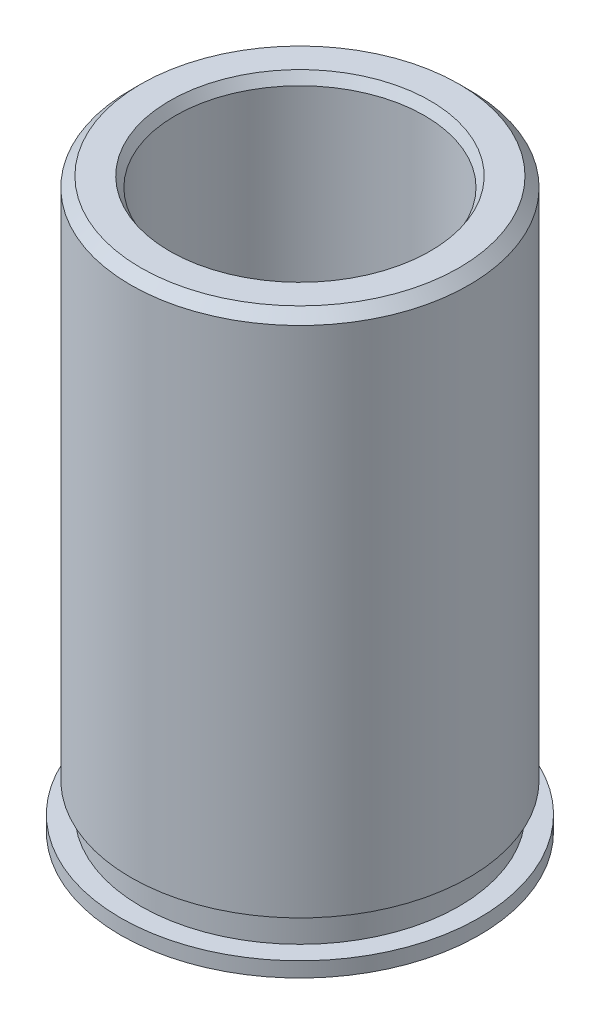
ISO-10303-21;
HEADER;
FILE_DESCRIPTION(('STEP AP214'),'2;1');
FILE_NAME('part.step','',(''),(''),'','','');
FILE_SCHEMA(('AUTOMOTIVE_DESIGN { 1 0 10303 214 1 1 1 1 }'));
ENDSEC;
DATA;
#1=APPLICATION_CONTEXT('core data for automotive mechanical design processes');
#2=APPLICATION_PROTOCOL_DEFINITION('international standard','automotive_design',2000,#1);
#3=PRODUCT_CONTEXT('',#1,'mechanical');
#4=PRODUCT('Part','Part','',(#3));
#5=PRODUCT_RELATED_PRODUCT_CATEGORY('part','',(#4));
#6=PRODUCT_DEFINITION_FORMATION('','',#4);
#7=PRODUCT_DEFINITION_CONTEXT('part definition',#1,'design');
#8=PRODUCT_DEFINITION('design','',#6,#7);
#9=PRODUCT_DEFINITION_SHAPE('','',#8);
#10=(LENGTH_UNIT() NAMED_UNIT(*) SI_UNIT(.MILLI.,.METRE.));
#11=(NAMED_UNIT(*) PLANE_ANGLE_UNIT() SI_UNIT($,.RADIAN.));
#12=(NAMED_UNIT(*) SI_UNIT($,.STERADIAN.) SOLID_ANGLE_UNIT());
#13=UNCERTAINTY_MEASURE_WITH_UNIT(LENGTH_MEASURE(1.E-05),#10,'distance_accuracy_value','');
#14=(GEOMETRIC_REPRESENTATION_CONTEXT(3) GLOBAL_UNCERTAINTY_ASSIGNED_CONTEXT((#13)) GLOBAL_UNIT_ASSIGNED_CONTEXT((#10,
#11,#12)) REPRESENTATION_CONTEXT('',''));
#15=CARTESIAN_POINT('',(0.,0.,0.));
#16=DIRECTION('',(0.,0.,1.));
#17=DIRECTION('',(1.,0.,0.));
#18=AXIS2_PLACEMENT_3D('',#15,#16,#17);
#19=CARTESIAN_POINT('',(0.,7.239,0.));
#20=DIRECTION('',(0.,1.,0.));
#21=DIRECTION('',(0.,0.,1.));
#22=AXIS2_PLACEMENT_3D('',#19,#20,#21);
#23=CYLINDRICAL_SURFACE('',#22,4.572);
#24=CARTESIAN_POINT('',(0.,-7.239,0.));
#25=DIRECTION('',(0.,1.,0.));
#26=DIRECTION('',(0.,0.,1.));
#27=AXIS2_PLACEMENT_3D('',#24,#25,#26);
#28=CIRCLE('',#27,4.572);
#29=CARTESIAN_POINT('',(0.,-7.239,4.572));
#30=VERTEX_POINT('',#29);
#31=EDGE_CURVE('E51',#30,#30,#28,.T.);
#32=ORIENTED_EDGE('',*,*,#31,.T.);
#33=EDGE_LOOP('',(#32));
#34=FACE_BOUND('',#33,.T.);
#35=CARTESIAN_POINT('',(0.,-6.858,0.));
#36=DIRECTION('',(0.,1.,0.));
#37=DIRECTION('',(0.,0.,1.));
#38=AXIS2_PLACEMENT_3D('',#35,#36,#37);
#39=CIRCLE('',#38,4.572);
#40=CARTESIAN_POINT('',(0.,-6.858,4.572));
#41=VERTEX_POINT('',#40);
#42=EDGE_CURVE('E9',#41,#41,#39,.T.);
#43=ORIENTED_EDGE('',*,*,#42,.F.);
#44=EDGE_LOOP('',(#43));
#45=FACE_BOUND('',#44,.T.);
#46=ADVANCED_FACE('F14',(#34,#45),#23,.T.);
#47=CARTESIAN_POINT('',(2.286,-6.858,0.));
#48=DIRECTION('',(0.,1.,0.));
#49=DIRECTION('',(0.,0.,1.));
#50=AXIS2_PLACEMENT_3D('',#47,#48,#49);
#51=PLANE('',#50);
#52=ORIENTED_EDGE('',*,*,#42,.T.);
#53=EDGE_LOOP('',(#52));
#54=FACE_BOUND('',#53,.T.);
#55=CARTESIAN_POINT('',(0.,-6.858,0.));
#56=DIRECTION('',(0.,1.,0.));
#57=DIRECTION('',(0.,0.,1.));
#58=AXIS2_PLACEMENT_3D('',#55,#56,#57);
#59=CIRCLE('',#58,4.05765);
#60=CARTESIAN_POINT('',(0.,-6.858,4.05765));
#61=VERTEX_POINT('',#60);
#62=EDGE_CURVE('E20',#61,#61,#59,.T.);
#63=ORIENTED_EDGE('',*,*,#62,.F.);
#64=EDGE_LOOP('',(#63));
#65=FACE_BOUND('',#64,.T.);
#66=ADVANCED_FACE('F77',(#54,#65),#51,.T.);
#67=CARTESIAN_POINT('',(0.,7.239,0.));
#68=DIRECTION('',(0.,1.,0.));
#69=DIRECTION('',(0.,0.,1.));
#70=AXIS2_PLACEMENT_3D('',#67,#68,#69);
#71=CYLINDRICAL_SURFACE('',#70,4.05765);
#72=ORIENTED_EDGE('',*,*,#62,.T.);
#73=EDGE_LOOP('',(#72));
#74=FACE_BOUND('',#73,.T.);
#75=CARTESIAN_POINT('',(0.,-6.096,0.));
#76=DIRECTION('',(0.,1.,0.));
#77=DIRECTION('',(0.,0.,1.));
#78=AXIS2_PLACEMENT_3D('',#75,#76,#77);
#79=CIRCLE('',#78,4.05765);
#80=CARTESIAN_POINT('',(0.,-6.096,4.05765));
#81=VERTEX_POINT('',#80);
#82=EDGE_CURVE('E24',#81,#81,#79,.T.);
#83=ORIENTED_EDGE('',*,*,#82,.F.);
#84=EDGE_LOOP('',(#83));
#85=FACE_BOUND('',#84,.T.);
#86=ADVANCED_FACE('F82',(#74,#85),#71,.T.);
#87=CARTESIAN_POINT('',(2.286,-6.096,0.));
#88=DIRECTION('',(0.,-1.,0.));
#89=DIRECTION('',(0.,0.,-1.));
#90=AXIS2_PLACEMENT_3D('',#87,#88,#89);
#91=PLANE('',#90);
#92=ORIENTED_EDGE('',*,*,#82,.T.);
#93=EDGE_LOOP('',(#92));
#94=FACE_BOUND('',#93,.T.);
#95=CARTESIAN_POINT('',(0.,-6.096,0.));
#96=DIRECTION('',(0.,1.,0.));
#97=DIRECTION('',(0.,0.,1.));
#98=AXIS2_PLACEMENT_3D('',#95,#96,#97);
#99=CIRCLE('',#98,4.31165);
#100=CARTESIAN_POINT('',(0.,-6.096,4.31165));
#101=VERTEX_POINT('',#100);
#102=EDGE_CURVE('E28',#101,#101,#99,.T.);
#103=ORIENTED_EDGE('',*,*,#102,.F.);
#104=EDGE_LOOP('',(#103));
#105=FACE_BOUND('',#104,.T.);
#106=ADVANCED_FACE('F87',(#94,#105),#91,.T.);
#107=CARTESIAN_POINT('',(0.,7.239,0.));
#108=DIRECTION('',(0.,1.,0.));
#109=DIRECTION('',(0.,0.,1.));
#110=AXIS2_PLACEMENT_3D('',#107,#108,#109);
#111=CYLINDRICAL_SURFACE('',#110,4.31165);
#112=ORIENTED_EDGE('',*,*,#102,.T.);
#113=EDGE_LOOP('',(#112));
#114=FACE_BOUND('',#113,.T.);
#115=CARTESIAN_POINT('',(0.,6.985,0.));
#116=DIRECTION('',(0.,1.,0.));
#117=DIRECTION('',(0.,0.,1.));
#118=AXIS2_PLACEMENT_3D('',#115,#116,#117);
#119=CIRCLE('',#118,4.31164999999999);
#120=CARTESIAN_POINT('',(0.,6.985,4.31164999999999));
#121=VERTEX_POINT('',#120);
#122=EDGE_CURVE('E33',#121,#121,#119,.T.);
#123=ORIENTED_EDGE('',*,*,#122,.F.);
#124=EDGE_LOOP('',(#123));
#125=FACE_BOUND('',#124,.T.);
#126=ADVANCED_FACE('F93',(#114,#125),#111,.T.);
#127=CARTESIAN_POINT('',(0.,7.239,0.));
#128=DIRECTION('',(0.,-1.,0.));
#129=DIRECTION('',(0.,0.,-1.));
#130=AXIS2_PLACEMENT_3D('',#127,#128,#129);
#131=CONICAL_SURFACE('',#130,4.05765,0.78539816339744);
#132=ORIENTED_EDGE('',*,*,#122,.T.);
#133=EDGE_LOOP('',(#132));
#134=FACE_BOUND('',#133,.T.);
#135=CARTESIAN_POINT('',(0.,7.239,0.));
#136=DIRECTION('',(0.,1.,0.));
#137=DIRECTION('',(0.,0.,1.));
#138=AXIS2_PLACEMENT_3D('',#135,#136,#137);
#139=CIRCLE('',#138,4.05765);
#140=CARTESIAN_POINT('',(0.,7.239,4.05765));
#141=VERTEX_POINT('',#140);
#142=EDGE_CURVE('E36',#141,#141,#139,.T.);
#143=ORIENTED_EDGE('',*,*,#142,.F.);
#144=EDGE_LOOP('',(#143));
#145=FACE_BOUND('',#144,.T.);
#146=ADVANCED_FACE('F97',(#134,#145),#131,.T.);
#147=CARTESIAN_POINT('',(2.286,7.239,0.));
#148=DIRECTION('',(0.,1.,0.));
#149=DIRECTION('',(0.,0.,1.));
#150=AXIS2_PLACEMENT_3D('',#147,#148,#149);
#151=PLANE('',#150);
#152=ORIENTED_EDGE('',*,*,#142,.T.);
#153=EDGE_LOOP('',(#152));
#154=FACE_BOUND('',#153,.T.);
#155=CARTESIAN_POINT('',(0.,7.239,0.));
#156=DIRECTION('',(0.,1.,0.));
#157=DIRECTION('',(0.,0.,1.));
#158=AXIS2_PLACEMENT_3D('',#155,#156,#157);
#159=CIRCLE('',#158,3.32164696837416);
#160=CARTESIAN_POINT('',(0.,7.239,3.32164696837416));
#161=VERTEX_POINT('',#160);
#162=EDGE_CURVE('E39',#161,#161,#159,.T.);
#163=ORIENTED_EDGE('',*,*,#162,.F.);
#164=EDGE_LOOP('',(#163));
#165=FACE_BOUND('',#164,.T.);
#166=ADVANCED_FACE('F101',(#154,#165),#151,.T.);
#167=CARTESIAN_POINT('',(0.,6.985,0.));
#168=DIRECTION('',(0.,1.,0.));
#169=DIRECTION('',(0.,0.,1.));
#170=AXIS2_PLACEMENT_3D('',#167,#168,#169);
#171=CONICAL_SURFACE('',#170,3.175,0.523598775598296);
#172=ORIENTED_EDGE('',*,*,#162,.T.);
#173=EDGE_LOOP('',(#172));
#174=FACE_BOUND('',#173,.T.);
#175=CARTESIAN_POINT('',(0.,6.985,0.));
#176=DIRECTION('',(0.,1.,0.));
#177=DIRECTION('',(0.,0.,1.));
#178=AXIS2_PLACEMENT_3D('',#175,#176,#177);
#179=CIRCLE('',#178,3.175);
#180=CARTESIAN_POINT('',(0.,6.985,3.175));
#181=VERTEX_POINT('',#180);
#182=EDGE_CURVE('E42',#181,#181,#179,.T.);
#183=ORIENTED_EDGE('',*,*,#182,.F.);
#184=EDGE_LOOP('',(#183));
#185=FACE_BOUND('',#184,.T.);
#186=ADVANCED_FACE('F73',(#174,#185),#171,.F.);
#187=CARTESIAN_POINT('',(0.,7.239,0.));
#188=DIRECTION('',(0.,1.,0.));
#189=DIRECTION('',(0.,0.,1.));
#190=AXIS2_PLACEMENT_3D('',#187,#188,#189);
#191=CYLINDRICAL_SURFACE('',#190,3.175);
#192=ORIENTED_EDGE('',*,*,#182,.T.);
#193=EDGE_LOOP('',(#192));
#194=FACE_BOUND('',#193,.T.);
#195=CARTESIAN_POINT('',(0.,-6.985,0.));
#196=DIRECTION('',(0.,1.,0.));
#197=DIRECTION('',(0.,0.,1.));
#198=AXIS2_PLACEMENT_3D('',#195,#196,#197);
#199=CIRCLE('',#198,3.175);
#200=CARTESIAN_POINT('',(0.,-6.985,3.175));
#201=VERTEX_POINT('',#200);
#202=EDGE_CURVE('E45',#201,#201,#199,.T.);
#203=ORIENTED_EDGE('',*,*,#202,.F.);
#204=EDGE_LOOP('',(#203));
#205=FACE_BOUND('',#204,.T.);
#206=ADVANCED_FACE('F65',(#194,#205),#191,.F.);
#207=CARTESIAN_POINT('',(0.,-7.239,0.));
#208=DIRECTION('',(0.,-1.,0.));
#209=DIRECTION('',(0.,0.,-1.));
#210=AXIS2_PLACEMENT_3D('',#207,#208,#209);
#211=CONICAL_SURFACE('',#210,3.32164696837416,0.523598775598303);
#212=ORIENTED_EDGE('',*,*,#202,.T.);
#213=EDGE_LOOP('',(#212));
#214=FACE_BOUND('',#213,.T.);
#215=CARTESIAN_POINT('',(0.,-7.239,0.));
#216=DIRECTION('',(0.,1.,0.));
#217=DIRECTION('',(0.,0.,1.));
#218=AXIS2_PLACEMENT_3D('',#215,#216,#217);
#219=CIRCLE('',#218,3.32164696837416);
#220=CARTESIAN_POINT('',(0.,-7.239,3.32164696837416));
#221=VERTEX_POINT('',#220);
#222=EDGE_CURVE('E48',#221,#221,#219,.T.);
#223=ORIENTED_EDGE('',*,*,#222,.F.);
#224=EDGE_LOOP('',(#223));
#225=FACE_BOUND('',#224,.T.);
#226=ADVANCED_FACE('F60',(#214,#225),#211,.F.);
#227=CARTESIAN_POINT('',(2.286,-7.239,0.));
#228=DIRECTION('',(0.,1.,0.));
#229=DIRECTION('',(0.,0.,1.));
#230=AXIS2_PLACEMENT_3D('',#227,#228,#229);
#231=PLANE('',#230);
#232=ORIENTED_EDGE('',*,*,#31,.F.);
#233=EDGE_LOOP('',(#232));
#234=FACE_BOUND('',#233,.T.);
#235=ORIENTED_EDGE('',*,*,#222,.T.);
#236=EDGE_LOOP('',(#235));
#237=FACE_BOUND('',#236,.T.);
#238=ADVANCED_FACE('F57',(#234,#237),#231,.F.);
#239=CLOSED_SHELL('',(#46,#66,#86,#106,#126,#146,#166,#186,#206,#226,#238));
#240=MANIFOLD_SOLID_BREP('B1',#239);
#241=ADVANCED_BREP_SHAPE_REPRESENTATION('',(#18,#240),#14);
#242=SHAPE_DEFINITION_REPRESENTATION(#9,#241);
ENDSEC;
END-ISO-10303-21;
